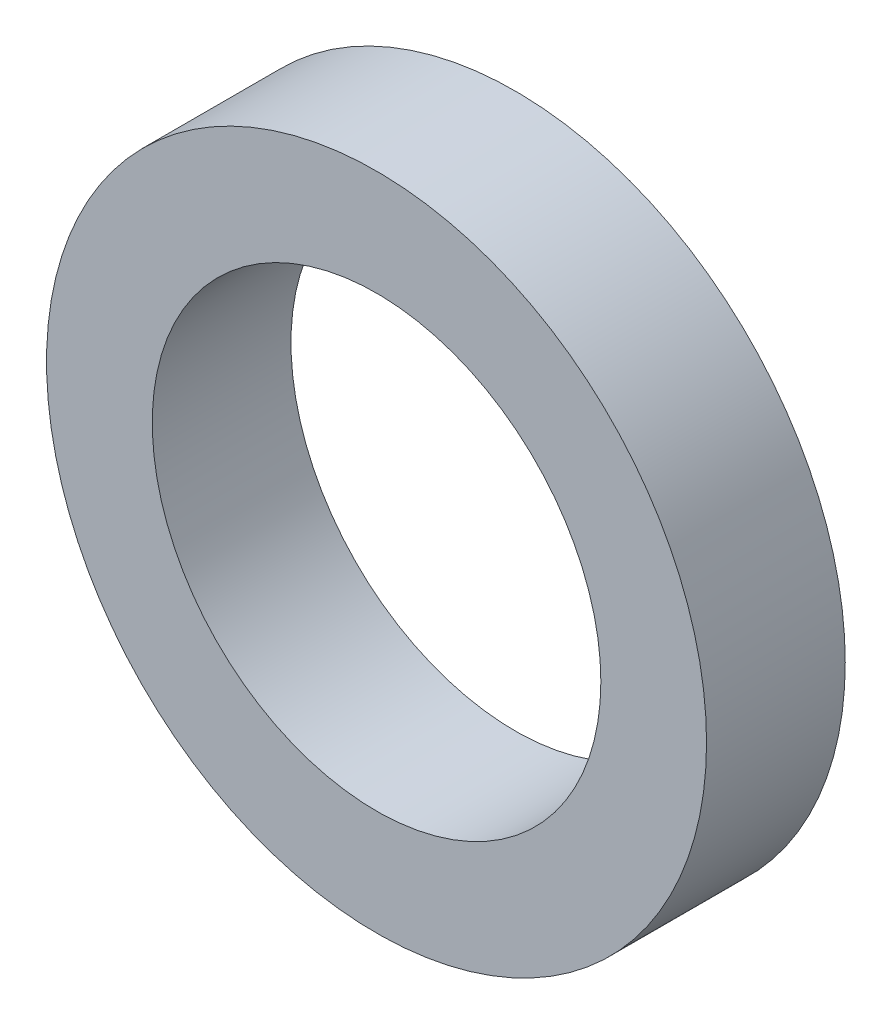
ISO-10303-21;
HEADER;
FILE_DESCRIPTION(('STEP AP214'),'2;1');
FILE_NAME('part.step','',(''),(''),'','','');
FILE_SCHEMA(('AUTOMOTIVE_DESIGN { 1 0 10303 214 1 1 1 1 }'));
ENDSEC;
DATA;
#1=APPLICATION_CONTEXT('core data for automotive mechanical design processes');
#2=APPLICATION_PROTOCOL_DEFINITION('international standard','automotive_design',2000,#1);
#3=PRODUCT_CONTEXT('',#1,'mechanical');
#4=PRODUCT('Part','Part','',(#3));
#5=PRODUCT_RELATED_PRODUCT_CATEGORY('part','',(#4));
#6=PRODUCT_DEFINITION_FORMATION('','',#4);
#7=PRODUCT_DEFINITION_CONTEXT('part definition',#1,'design');
#8=PRODUCT_DEFINITION('design','',#6,#7);
#9=PRODUCT_DEFINITION_SHAPE('','',#8);
#10=(LENGTH_UNIT() NAMED_UNIT(*) SI_UNIT(.MILLI.,.METRE.));
#11=(NAMED_UNIT(*) PLANE_ANGLE_UNIT() SI_UNIT($,.RADIAN.));
#12=(NAMED_UNIT(*) SI_UNIT($,.STERADIAN.) SOLID_ANGLE_UNIT());
#13=UNCERTAINTY_MEASURE_WITH_UNIT(LENGTH_MEASURE(1.E-05),#10,'distance_accuracy_value','');
#14=(GEOMETRIC_REPRESENTATION_CONTEXT(3) GLOBAL_UNCERTAINTY_ASSIGNED_CONTEXT((#13)) GLOBAL_UNIT_ASSIGNED_CONTEXT((#10,
#11,#12)) REPRESENTATION_CONTEXT('',''));
#15=CARTESIAN_POINT('',(0.,0.,0.));
#16=DIRECTION('',(0.,0.,1.));
#17=DIRECTION('',(1.,0.,0.));
#18=AXIS2_PLACEMENT_3D('',#15,#16,#17);
#19=CARTESIAN_POINT('',(0.,0.,53.8));
#20=DIRECTION('',(0.,0.,1.));
#21=DIRECTION('',(1.,0.,0.));
#22=AXIS2_PLACEMENT_3D('',#19,#20,#21);
#23=PLANE('',#22);
#24=CARTESIAN_POINT('',(0.,0.,53.8));
#25=DIRECTION('',(0.,0.,1.));
#26=DIRECTION('',(1.,0.,0.));
#27=AXIS2_PLACEMENT_3D('',#24,#25,#26);
#28=CIRCLE('',#27,128.);
#29=CARTESIAN_POINT('',(128.,0.,53.8));
#30=VERTEX_POINT('',#29);
#31=EDGE_CURVE('E11',#30,#30,#28,.T.);
#32=ORIENTED_EDGE('',*,*,#31,.T.);
#33=EDGE_LOOP('',(#32));
#34=FACE_BOUND('',#33,.T.);
#35=CARTESIAN_POINT('',(0.,0.,53.8));
#36=DIRECTION('',(0.,0.,1.));
#37=DIRECTION('',(1.,0.,0.));
#38=AXIS2_PLACEMENT_3D('',#35,#36,#37);
#39=CIRCLE('',#38,87.);
#40=CARTESIAN_POINT('',(87.,0.,53.8));
#41=VERTEX_POINT('',#40);
#42=EDGE_CURVE('E50',#41,#41,#39,.T.);
#43=ORIENTED_EDGE('',*,*,#42,.F.);
#44=EDGE_LOOP('',(#43));
#45=FACE_BOUND('',#44,.T.);
#46=ADVANCED_FACE('F39',(#34,#45),#23,.T.);
#47=CARTESIAN_POINT('',(0.,0.,0.));
#48=DIRECTION('',(0.,0.,1.));
#49=DIRECTION('',(1.,0.,0.));
#50=AXIS2_PLACEMENT_3D('',#47,#48,#49);
#51=PLANE('',#50);
#52=CARTESIAN_POINT('',(0.,0.,0.));
#53=DIRECTION('',(0.,0.,1.));
#54=DIRECTION('',(1.,0.,0.));
#55=AXIS2_PLACEMENT_3D('',#52,#53,#54);
#56=CIRCLE('',#55,128.);
#57=CARTESIAN_POINT('',(128.,0.,0.));
#58=VERTEX_POINT('',#57);
#59=EDGE_CURVE('E43',#58,#58,#56,.T.);
#60=ORIENTED_EDGE('',*,*,#59,.F.);
#61=EDGE_LOOP('',(#60));
#62=FACE_BOUND('',#61,.T.);
#63=CARTESIAN_POINT('',(0.,0.,0.));
#64=DIRECTION('',(0.,0.,1.));
#65=DIRECTION('',(1.,0.,0.));
#66=AXIS2_PLACEMENT_3D('',#63,#64,#65);
#67=CIRCLE('',#66,87.);
#68=CARTESIAN_POINT('',(87.,0.,0.));
#69=VERTEX_POINT('',#68);
#70=EDGE_CURVE('E52',#69,#69,#67,.T.);
#71=ORIENTED_EDGE('',*,*,#70,.T.);
#72=EDGE_LOOP('',(#71));
#73=FACE_BOUND('',#72,.T.);
#74=ADVANCED_FACE('F62',(#62,#73),#51,.F.);
#75=CARTESIAN_POINT('',(0.,0.,53.8));
#76=DIRECTION('',(0.,0.,-1.));
#77=DIRECTION('',(-1.,0.,0.));
#78=AXIS2_PLACEMENT_3D('',#75,#76,#77);
#79=CYLINDRICAL_SURFACE('',#78,128.);
#80=ORIENTED_EDGE('',*,*,#31,.F.);
#81=EDGE_LOOP('',(#80));
#82=FACE_BOUND('',#81,.T.);
#83=ORIENTED_EDGE('',*,*,#59,.T.);
#84=EDGE_LOOP('',(#83));
#85=FACE_BOUND('',#84,.T.);
#86=ADVANCED_FACE('F41',(#82,#85),#79,.T.);
#87=CARTESIAN_POINT('',(0.,0.,53.8));
#88=DIRECTION('',(0.,0.,-1.));
#89=DIRECTION('',(-1.,0.,0.));
#90=AXIS2_PLACEMENT_3D('',#87,#88,#89);
#91=CYLINDRICAL_SURFACE('',#90,87.);
#92=ORIENTED_EDGE('',*,*,#42,.T.);
#93=EDGE_LOOP('',(#92));
#94=FACE_BOUND('',#93,.T.);
#95=ORIENTED_EDGE('',*,*,#70,.F.);
#96=EDGE_LOOP('',(#95));
#97=FACE_BOUND('',#96,.T.);
#98=ADVANCED_FACE('F58',(#94,#97),#91,.F.);
#99=CLOSED_SHELL('',(#46,#74,#86,#98));
#100=MANIFOLD_SOLID_BREP('B2',#99);
#101=ADVANCED_BREP_SHAPE_REPRESENTATION('',(#18,#100),#14);
#102=SHAPE_DEFINITION_REPRESENTATION(#9,#101);
ENDSEC;
END-ISO-10303-21;
